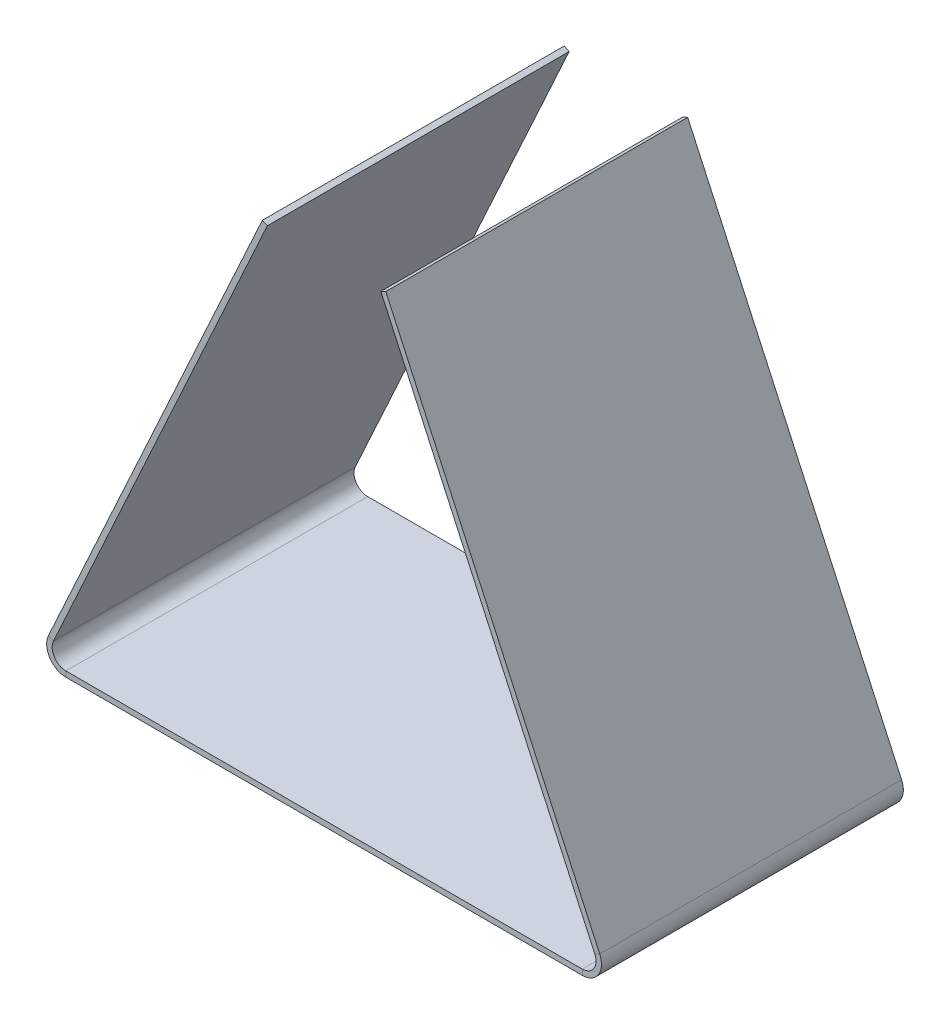
ISO-10303-21;
HEADER;
FILE_DESCRIPTION(('STEP AP214'),'2;1');
FILE_NAME('part.step','',(''),(''),'','','');
FILE_SCHEMA(('AUTOMOTIVE_DESIGN { 1 0 10303 214 1 1 1 1 }'));
ENDSEC;
DATA;
#1=APPLICATION_CONTEXT('core data for automotive mechanical design processes');
#2=APPLICATION_PROTOCOL_DEFINITION('international standard','automotive_design',2000,#1);
#3=PRODUCT_CONTEXT('',#1,'mechanical');
#4=PRODUCT('Part','Part','',(#3));
#5=PRODUCT_RELATED_PRODUCT_CATEGORY('part','',(#4));
#6=PRODUCT_DEFINITION_FORMATION('','',#4);
#7=PRODUCT_DEFINITION_CONTEXT('part definition',#1,'design');
#8=PRODUCT_DEFINITION('design','',#6,#7);
#9=PRODUCT_DEFINITION_SHAPE('','',#8);
#10=(LENGTH_UNIT() NAMED_UNIT(*) SI_UNIT(.MILLI.,.METRE.));
#11=(NAMED_UNIT(*) PLANE_ANGLE_UNIT() SI_UNIT($,.RADIAN.));
#12=(NAMED_UNIT(*) SI_UNIT($,.STERADIAN.) SOLID_ANGLE_UNIT());
#13=UNCERTAINTY_MEASURE_WITH_UNIT(LENGTH_MEASURE(1.E-05),#10,'distance_accuracy_value','');
#14=(GEOMETRIC_REPRESENTATION_CONTEXT(3) GLOBAL_UNCERTAINTY_ASSIGNED_CONTEXT((#13)) GLOBAL_UNIT_ASSIGNED_CONTEXT((#10,
#11,#12)) REPRESENTATION_CONTEXT('',''));
#15=CARTESIAN_POINT('',(0.,0.,0.));
#16=DIRECTION('',(0.,0.,1.));
#17=DIRECTION('',(1.,0.,0.));
#18=AXIS2_PLACEMENT_3D('',#15,#16,#17);
#19=CARTESIAN_POINT('',(101.883270202925,2.,1.99840144432528E-12));
#20=DIRECTION('',(0.,0.,0.999999999999997));
#21=DIRECTION('',(-0.999999999999995,0.,0.));
#22=AXIS2_PLACEMENT_3D('',#19,#20,#21);
#23=PLANE('',#22);
#24=DIRECTION('',(0.,0.999999999999997,0.));
#25=VECTOR('',#24,1.);
#26=CARTESIAN_POINT('',(94.0914457102403,2.,1.11022302462516E-12));
#27=LINE('',#26,#25);
#28=CARTESIAN_POINT('',(94.0914457102403,0.,4.44089209850063E-13));
#29=VERTEX_POINT('',#28);
#30=CARTESIAN_POINT('',(94.0914457102403,2.,1.11022302462516E-12));
#31=VERTEX_POINT('',#30);
#32=EDGE_CURVE('E11',#29,#31,#27,.T.);
#33=ORIENTED_EDGE('',*,*,#32,.F.);
#34=DIRECTION('',(0.999999999999995,0.,0.));
#35=VECTOR('',#34,1.);
#36=CARTESIAN_POINT('',(101.883270202925,1.11022302462516E-13,1.66533453693773E-13));
#37=LINE('',#36,#35);
#38=CARTESIAN_POINT('',(-94.0914457102404,-1.11022302462516E-13,0.));
#39=VERTEX_POINT('',#38);
#40=EDGE_CURVE('E95',#29,#39,#37,.F.);
#41=ORIENTED_EDGE('',*,*,#40,.T.);
#42=DIRECTION('',(0.,0.999999999999997,0.));
#43=VECTOR('',#42,1.);
#44=CARTESIAN_POINT('',(-94.0914457102404,1.99999999999989,1.99840144432528E-12));
#45=LINE('',#44,#43);
#46=CARTESIAN_POINT('',(-94.0914457102404,1.99999999999989,1.99840144432528E-12));
#47=VERTEX_POINT('',#46);
#48=EDGE_CURVE('E48',#39,#47,#45,.T.);
#49=ORIENTED_EDGE('',*,*,#48,.T.);
#50=DIRECTION('',(-0.999999999999995,0.,0.));
#51=VECTOR('',#50,1.);
#52=CARTESIAN_POINT('',(101.883270202925,2.,1.99840144432528E-12));
#53=LINE('',#52,#51);
#54=EDGE_CURVE('E97',#31,#47,#53,.T.);
#55=ORIENTED_EDGE('',*,*,#54,.F.);
#56=EDGE_LOOP('',(#33,#41,#49,#55));
#57=FACE_BOUND('',#56,.T.);
#58=ADVANCED_FACE('F38',(#57),#23,.F.);
#59=CARTESIAN_POINT('',(-94.0914457102404,7.00000000000012,6.66133814775094E-13));
#60=DIRECTION('',(0.,0.,-0.999999999999997));
#61=DIRECTION('',(-0.999999999999995,0.,0.));
#62=AXIS2_PLACEMENT_3D('',#59,#60,#61);
#63=PLANE('',#62);
#64=ORIENTED_EDGE('',*,*,#48,.F.);
#65=CARTESIAN_POINT('',(-94.0914457102404,7.00000000000012,6.66133814775094E-13));
#66=DIRECTION('',(0.,0.,0.999999999999997));
#67=DIRECTION('',(0.999999999999995,0.,0.));
#68=AXIS2_PLACEMENT_3D('',#65,#66,#67);
#69=CIRCLE('',#68,7.);
#70=CARTESIAN_POINT('',(-100.4548994705,9.91658297345266,4.44089209850063E-13));
#71=VERTEX_POINT('',#70);
#72=EDGE_CURVE('E136',#39,#71,#69,.F.);
#73=ORIENTED_EDGE('',*,*,#72,.T.);
#74=DIRECTION('',(0.909064822894279,-0.416654710493212,0.));
#75=VECTOR('',#74,1.);
#76=CARTESIAN_POINT('',(-98.6367698247118,9.08327355246607,0.));
#77=LINE('',#76,#75);
#78=CARTESIAN_POINT('',(-98.6367698247118,9.08327355246607,0.));
#79=VERTEX_POINT('',#78);
#80=EDGE_CURVE('E163',#71,#79,#77,.T.);
#81=ORIENTED_EDGE('',*,*,#80,.T.);
#82=CARTESIAN_POINT('',(-94.0914457102404,7.00000000000012,6.66133814775094E-13));
#83=DIRECTION('',(0.,0.,0.999999999999997));
#84=DIRECTION('',(0.999999999999995,0.,0.));
#85=AXIS2_PLACEMENT_3D('',#82,#83,#84);
#86=CIRCLE('',#85,5.);
#87=EDGE_CURVE('E172',#47,#79,#86,.F.);
#88=ORIENTED_EDGE('',*,*,#87,.F.);
#89=EDGE_LOOP('',(#64,#73,#81,#88));
#90=FACE_BOUND('',#89,.T.);
#91=ADVANCED_FACE('F171',(#90),#63,.T.);
#92=CARTESIAN_POINT('',(-20.6818703542114,179.166690579013,0.));
#93=DIRECTION('',(0.,0.,0.999999999999997));
#94=DIRECTION('',(0.416654710493211,0.909064822894282,0.));
#95=AXIS2_PLACEMENT_3D('',#92,#93,#94);
#96=PLANE('',#95);
#97=ORIENTED_EDGE('',*,*,#80,.F.);
#98=DIRECTION('',(-0.416654710493211,-0.909064822894282,0.));
#99=VECTOR('',#98,1.);
#100=CARTESIAN_POINT('',(-22.5,179.999999999999,0.));
#101=LINE('',#100,#99);
#102=CARTESIAN_POINT('',(-22.5,179.999999999999,0.));
#103=VERTEX_POINT('',#102);
#104=EDGE_CURVE('E133',#71,#103,#101,.F.);
#105=ORIENTED_EDGE('',*,*,#104,.T.);
#106=DIRECTION('',(0.909064822894279,-0.416654710493212,0.));
#107=VECTOR('',#106,1.);
#108=CARTESIAN_POINT('',(-20.6818703542114,179.166690579013,0.));
#109=LINE('',#108,#107);
#110=CARTESIAN_POINT('',(-20.6818703542114,179.166690579013,0.));
#111=VERTEX_POINT('',#110);
#112=EDGE_CURVE('E160',#103,#111,#109,.T.);
#113=ORIENTED_EDGE('',*,*,#112,.T.);
#114=DIRECTION('',(0.416654710493211,0.909064822894282,0.));
#115=VECTOR('',#114,1.);
#116=CARTESIAN_POINT('',(-20.6818703542114,179.166690579013,0.));
#117=LINE('',#116,#115);
#118=EDGE_CURVE('E191',#79,#111,#117,.T.);
#119=ORIENTED_EDGE('',*,*,#118,.F.);
#120=EDGE_LOOP('',(#97,#105,#113,#119));
#121=FACE_BOUND('',#120,.T.);
#122=ADVANCED_FACE('F192',(#121),#96,.F.);
#123=CARTESIAN_POINT('',(-20.6818703542114,179.166690579013,110.000000000001));
#124=DIRECTION('',(0.416654710493211,0.909064822894282,0.));
#125=DIRECTION('',(0.,0.,-0.999999999999997));
#126=AXIS2_PLACEMENT_3D('',#123,#124,#125);
#127=PLANE('',#126);
#128=ORIENTED_EDGE('',*,*,#112,.F.);
#129=DIRECTION('',(0.,0.,0.999999999999997));
#130=VECTOR('',#129,1.);
#131=CARTESIAN_POINT('',(-22.4999999999999,179.999999999999,110.));
#132=LINE('',#131,#130);
#133=CARTESIAN_POINT('',(-22.4999999999999,179.999999999999,110.));
#134=VERTEX_POINT('',#133);
#135=EDGE_CURVE('E229',#134,#103,#132,.F.);
#136=ORIENTED_EDGE('',*,*,#135,.F.);
#137=DIRECTION('',(0.909064822894279,-0.416654710493212,0.));
#138=VECTOR('',#137,1.);
#139=CARTESIAN_POINT('',(-20.6818703542114,179.166690579013,110.000000000001));
#140=LINE('',#139,#138);
#141=CARTESIAN_POINT('',(-20.6818703542114,179.166690579013,110.000000000001));
#142=VERTEX_POINT('',#141);
#143=EDGE_CURVE('E157',#134,#142,#140,.T.);
#144=ORIENTED_EDGE('',*,*,#143,.T.);
#145=DIRECTION('',(0.,0.,-0.999999999999997));
#146=VECTOR('',#145,1.);
#147=CARTESIAN_POINT('',(-20.6818703542114,179.166690579013,110.000000000001));
#148=LINE('',#147,#146);
#149=EDGE_CURVE('E196',#142,#111,#148,.T.);
#150=ORIENTED_EDGE('',*,*,#149,.T.);
#151=EDGE_LOOP('',(#128,#136,#144,#150));
#152=FACE_BOUND('',#151,.T.);
#153=ADVANCED_FACE('F240',(#152),#127,.T.);
#154=CARTESIAN_POINT('',(-20.6818703542114,179.166690579013,110.000000000001));
#155=DIRECTION('',(0.,0.,0.999999999999997));
#156=DIRECTION('',(0.416654710493211,0.909064822894282,0.));
#157=AXIS2_PLACEMENT_3D('',#154,#155,#156);
#158=PLANE('',#157);
#159=ORIENTED_EDGE('',*,*,#143,.F.);
#160=DIRECTION('',(-0.416654710493211,-0.909064822894282,0.));
#161=VECTOR('',#160,1.);
#162=CARTESIAN_POINT('',(-22.4999999999999,179.999999999999,110.));
#163=LINE('',#162,#161);
#164=CARTESIAN_POINT('',(-100.4548994705,9.91658297345244,110.000000000002));
#165=VERTEX_POINT('',#164);
#166=EDGE_CURVE('E126',#165,#134,#163,.F.);
#167=ORIENTED_EDGE('',*,*,#166,.F.);
#168=DIRECTION('',(0.909064822894276,-0.416654710493219,0.));
#169=VECTOR('',#168,1.);
#170=CARTESIAN_POINT('',(-98.6367698247117,9.08327355246607,110.));
#171=LINE('',#170,#169);
#172=CARTESIAN_POINT('',(-98.6367698247117,9.08327355246607,110.));
#173=VERTEX_POINT('',#172);
#174=EDGE_CURVE('E154',#165,#173,#171,.T.);
#175=ORIENTED_EDGE('',*,*,#174,.T.);
#176=DIRECTION('',(0.416654710493211,0.909064822894282,0.));
#177=VECTOR('',#176,1.);
#178=CARTESIAN_POINT('',(-20.6818703542114,179.166690579013,110.000000000001));
#179=LINE('',#178,#177);
#180=EDGE_CURVE('E202',#173,#142,#179,.T.);
#181=ORIENTED_EDGE('',*,*,#180,.T.);
#182=EDGE_LOOP('',(#159,#167,#175,#181));
#183=FACE_BOUND('',#182,.T.);
#184=ADVANCED_FACE('F290',(#183),#158,.T.);
#185=CARTESIAN_POINT('',(-94.0914457102403,6.9999999999999,110.000000000001));
#186=DIRECTION('',(0.,0.,0.999999999999997));
#187=DIRECTION('',(0.999999999999995,0.,0.));
#188=AXIS2_PLACEMENT_3D('',#185,#186,#187);
#189=PLANE('',#188);
#190=ORIENTED_EDGE('',*,*,#174,.F.);
#191=CARTESIAN_POINT('',(-94.0914457102403,6.9999999999999,110.000000000001));
#192=DIRECTION('',(0.,0.,0.999999999999997));
#193=DIRECTION('',(0.999999999999995,0.,0.));
#194=AXIS2_PLACEMENT_3D('',#191,#192,#193);
#195=CIRCLE('',#194,7.);
#196=CARTESIAN_POINT('',(-94.0914457102402,1.11022302462516E-13,110.000000000002));
#197=VERTEX_POINT('',#196);
#198=EDGE_CURVE('E131',#165,#197,#195,.T.);
#199=ORIENTED_EDGE('',*,*,#198,.T.);
#200=DIRECTION('',(0.,0.999999999999997,0.));
#201=VECTOR('',#200,1.);
#202=CARTESIAN_POINT('',(-94.0914457102403,1.99999999999967,110.));
#203=LINE('',#202,#201);
#204=CARTESIAN_POINT('',(-94.0914457102403,1.99999999999967,110.));
#205=VERTEX_POINT('',#204);
#206=EDGE_CURVE('E152',#197,#205,#203,.T.);
#207=ORIENTED_EDGE('',*,*,#206,.T.);
#208=CARTESIAN_POINT('',(-94.0914457102403,6.9999999999999,110.000000000001));
#209=DIRECTION('',(0.,0.,-0.999999999999997));
#210=DIRECTION('',(-0.999999999999995,0.,0.));
#211=AXIS2_PLACEMENT_3D('',#208,#209,#210);
#212=CIRCLE('',#211,5.);
#213=EDGE_CURVE('E188',#173,#205,#212,.F.);
#214=ORIENTED_EDGE('',*,*,#213,.F.);
#215=EDGE_LOOP('',(#190,#199,#207,#214));
#216=FACE_BOUND('',#215,.T.);
#217=ADVANCED_FACE('F292',(#216),#189,.T.);
#218=CARTESIAN_POINT('',(101.883270202925,1.99999999999978,110.));
#219=DIRECTION('',(0.,0.,0.999999999999997));
#220=DIRECTION('',(-0.999999999999995,0.,0.));
#221=AXIS2_PLACEMENT_3D('',#218,#219,#220);
#222=PLANE('',#221);
#223=ORIENTED_EDGE('',*,*,#206,.F.);
#224=DIRECTION('',(0.999999999999995,0.,0.));
#225=VECTOR('',#224,1.);
#226=CARTESIAN_POINT('',(101.883270202925,1.11022302462516E-13,110.000000000001));
#227=LINE('',#226,#225);
#228=CARTESIAN_POINT('',(94.0914457102404,0.,110.000000000001));
#229=VERTEX_POINT('',#228);
#230=EDGE_CURVE('E125',#229,#197,#227,.F.);
#231=ORIENTED_EDGE('',*,*,#230,.F.);
#232=DIRECTION('',(0.,0.999999999999997,0.));
#233=VECTOR('',#232,1.);
#234=CARTESIAN_POINT('',(94.0914457102404,1.99999999999978,110.));
#235=LINE('',#234,#233);
#236=CARTESIAN_POINT('',(94.0914457102404,1.99999999999978,110.));
#237=VERTEX_POINT('',#236);
#238=EDGE_CURVE('E149',#229,#237,#235,.T.);
#239=ORIENTED_EDGE('',*,*,#238,.T.);
#240=DIRECTION('',(-0.999999999999995,0.,0.));
#241=VECTOR('',#240,1.);
#242=CARTESIAN_POINT('',(101.883270202925,1.99999999999978,110.));
#243=LINE('',#242,#241);
#244=EDGE_CURVE('E247',#237,#205,#243,.T.);
#245=ORIENTED_EDGE('',*,*,#244,.T.);
#246=EDGE_LOOP('',(#223,#231,#239,#245));
#247=FACE_BOUND('',#246,.T.);
#248=ADVANCED_FACE('F295',(#247),#222,.T.);
#249=CARTESIAN_POINT('',(94.0914457102404,6.9999999999999,110.000000000001));
#250=DIRECTION('',(0.,0.,0.999999999999997));
#251=DIRECTION('',(0.999999999999995,0.,0.));
#252=AXIS2_PLACEMENT_3D('',#249,#250,#251);
#253=PLANE('',#252);
#254=ORIENTED_EDGE('',*,*,#238,.F.);
#255=CARTESIAN_POINT('',(94.0914457102404,6.9999999999999,110.000000000001));
#256=DIRECTION('',(0.,0.,0.999999999999997));
#257=DIRECTION('',(0.999999999999995,0.,0.));
#258=AXIS2_PLACEMENT_3D('',#255,#256,#257);
#259=CIRCLE('',#258,7.);
#260=CARTESIAN_POINT('',(100.4548994705,9.91658297345232,110.000000000002));
#261=VERTEX_POINT('',#260);
#262=EDGE_CURVE('E113',#229,#261,#259,.T.);
#263=ORIENTED_EDGE('',*,*,#262,.T.);
#264=DIRECTION('',(-0.909064822894279,-0.416654710493213,0.));
#265=VECTOR('',#264,1.);
#266=CARTESIAN_POINT('',(98.6367698247118,9.08327355246585,110.000000000002));
#267=LINE('',#266,#265);
#268=CARTESIAN_POINT('',(98.6367698247118,9.08327355246585,110.000000000002));
#269=VERTEX_POINT('',#268);
#270=EDGE_CURVE('E146',#261,#269,#267,.T.);
#271=ORIENTED_EDGE('',*,*,#270,.T.);
#272=CARTESIAN_POINT('',(94.0914457102404,6.9999999999999,110.000000000001));
#273=DIRECTION('',(0.,0.,-0.999999999999997));
#274=DIRECTION('',(-0.999999999999995,0.,0.));
#275=AXIS2_PLACEMENT_3D('',#272,#273,#274);
#276=CIRCLE('',#275,5.);
#277=EDGE_CURVE('E197',#237,#269,#276,.F.);
#278=ORIENTED_EDGE('',*,*,#277,.F.);
#279=EDGE_LOOP('',(#254,#263,#271,#278));
#280=FACE_BOUND('',#279,.T.);
#281=ADVANCED_FACE('F322',(#280),#253,.T.);
#282=CARTESIAN_POINT('',(20.6818703542113,179.166690579013,110.000000000001));
#283=DIRECTION('',(0.,0.,0.999999999999997));
#284=DIRECTION('',(0.416654710493211,-0.909064822894281,0.));
#285=AXIS2_PLACEMENT_3D('',#282,#283,#284);
#286=PLANE('',#285);
#287=ORIENTED_EDGE('',*,*,#270,.F.);
#288=DIRECTION('',(-0.416654710493211,0.909064822894281,0.));
#289=VECTOR('',#288,1.);
#290=CARTESIAN_POINT('',(22.4999999999998,179.999999999999,110.));
#291=LINE('',#290,#289);
#292=CARTESIAN_POINT('',(22.4999999999998,179.999999999999,110.));
#293=VERTEX_POINT('',#292);
#294=EDGE_CURVE('E221',#293,#261,#291,.F.);
#295=ORIENTED_EDGE('',*,*,#294,.F.);
#296=DIRECTION('',(-0.909064822894279,-0.416654710493213,0.));
#297=VECTOR('',#296,1.);
#298=CARTESIAN_POINT('',(20.6818703542113,179.166690579013,110.000000000001));
#299=LINE('',#298,#297);
#300=CARTESIAN_POINT('',(20.6818703542113,179.166690579013,110.000000000001));
#301=VERTEX_POINT('',#300);
#302=EDGE_CURVE('E143',#293,#301,#299,.T.);
#303=ORIENTED_EDGE('',*,*,#302,.T.);
#304=DIRECTION('',(0.416654710493211,-0.909064822894281,0.));
#305=VECTOR('',#304,1.);
#306=CARTESIAN_POINT('',(20.6818703542113,179.166690579013,110.000000000001));
#307=LINE('',#306,#305);
#308=EDGE_CURVE('E253',#301,#269,#307,.T.);
#309=ORIENTED_EDGE('',*,*,#308,.T.);
#310=EDGE_LOOP('',(#287,#295,#303,#309));
#311=FACE_BOUND('',#310,.T.);
#312=ADVANCED_FACE('F271',(#311),#286,.T.);
#313=CARTESIAN_POINT('',(20.6818703542113,179.166690579013,110.000000000001));
#314=DIRECTION('',(0.416654710493211,-0.909064822894281,0.));
#315=DIRECTION('',(0.,0.,-0.999999999999997));
#316=AXIS2_PLACEMENT_3D('',#313,#314,#315);
#317=PLANE('',#316);
#318=ORIENTED_EDGE('',*,*,#302,.F.);
#319=DIRECTION('',(0.,0.,0.999999999999997));
#320=VECTOR('',#319,1.);
#321=CARTESIAN_POINT('',(22.4999999999998,179.999999999999,110.));
#322=LINE('',#321,#320);
#323=CARTESIAN_POINT('',(22.4999999999998,179.999999999999,0.));
#324=VERTEX_POINT('',#323);
#325=EDGE_CURVE('E118',#293,#324,#322,.F.);
#326=ORIENTED_EDGE('',*,*,#325,.T.);
#327=DIRECTION('',(-0.909064822894279,-0.416654710493213,0.));
#328=VECTOR('',#327,1.);
#329=CARTESIAN_POINT('',(20.6818703542113,179.166690579013,0.));
#330=LINE('',#329,#328);
#331=CARTESIAN_POINT('',(20.6818703542113,179.166690579013,0.));
#332=VERTEX_POINT('',#331);
#333=EDGE_CURVE('E140',#324,#332,#330,.T.);
#334=ORIENTED_EDGE('',*,*,#333,.T.);
#335=DIRECTION('',(0.,0.,-0.999999999999997));
#336=VECTOR('',#335,1.);
#337=CARTESIAN_POINT('',(20.6818703542113,179.166690579013,110.000000000001));
#338=LINE('',#337,#336);
#339=EDGE_CURVE('E256',#301,#332,#338,.T.);
#340=ORIENTED_EDGE('',*,*,#339,.F.);
#341=EDGE_LOOP('',(#318,#326,#334,#340));
#342=FACE_BOUND('',#341,.T.);
#343=ADVANCED_FACE('F327',(#342),#317,.F.);
#344=CARTESIAN_POINT('',(20.6818703542113,179.166690579013,0.));
#345=DIRECTION('',(0.,0.,0.999999999999997));
#346=DIRECTION('',(0.416654710493211,-0.909064822894281,0.));
#347=AXIS2_PLACEMENT_3D('',#344,#345,#346);
#348=PLANE('',#347);
#349=ORIENTED_EDGE('',*,*,#333,.F.);
#350=DIRECTION('',(-0.416654710493211,0.909064822894281,0.));
#351=VECTOR('',#350,1.);
#352=CARTESIAN_POINT('',(22.4999999999998,179.999999999999,0.));
#353=LINE('',#352,#351);
#354=CARTESIAN_POINT('',(100.4548994705,9.91658297345266,1.27675647831893E-12));
#355=VERTEX_POINT('',#354);
#356=EDGE_CURVE('E219',#324,#355,#353,.F.);
#357=ORIENTED_EDGE('',*,*,#356,.T.);
#358=DIRECTION('',(-0.909064822894279,-0.416654710493212,0.));
#359=VECTOR('',#358,1.);
#360=CARTESIAN_POINT('',(98.6367698247117,9.08327355246596,1.11022302462516E-12));
#361=LINE('',#360,#359);
#362=CARTESIAN_POINT('',(98.6367698247117,9.08327355246596,1.11022302462516E-12));
#363=VERTEX_POINT('',#362);
#364=EDGE_CURVE('E42',#355,#363,#361,.T.);
#365=ORIENTED_EDGE('',*,*,#364,.T.);
#366=DIRECTION('',(0.416654710493211,-0.909064822894281,0.));
#367=VECTOR('',#366,1.);
#368=CARTESIAN_POINT('',(20.6818703542113,179.166690579013,0.));
#369=LINE('',#368,#367);
#370=EDGE_CURVE('E250',#332,#363,#369,.T.);
#371=ORIENTED_EDGE('',*,*,#370,.F.);
#372=EDGE_LOOP('',(#349,#357,#365,#371));
#373=FACE_BOUND('',#372,.T.);
#374=ADVANCED_FACE('F281',(#373),#348,.F.);
#375=CARTESIAN_POINT('',(94.0914457102403,7.00000000000001,-2.77555756156289E-13));
#376=DIRECTION('',(0.,0.,-0.999999999999997));
#377=DIRECTION('',(-0.999999999999995,0.,0.));
#378=AXIS2_PLACEMENT_3D('',#375,#376,#377);
#379=PLANE('',#378);
#380=CARTESIAN_POINT('',(94.0914457102403,7.00000000000001,-2.77555756156289E-13));
#381=DIRECTION('',(0.,0.,0.999999999999997));
#382=DIRECTION('',(0.999999999999995,0.,0.));
#383=AXIS2_PLACEMENT_3D('',#380,#381,#382);
#384=CIRCLE('',#383,7.);
#385=EDGE_CURVE('E110',#355,#29,#384,.F.);
#386=ORIENTED_EDGE('',*,*,#385,.T.);
#387=ORIENTED_EDGE('',*,*,#32,.T.);
#388=CARTESIAN_POINT('',(94.0914457102403,7.00000000000001,-2.77555756156289E-13));
#389=DIRECTION('',(0.,0.,0.999999999999997));
#390=DIRECTION('',(0.999999999999995,0.,0.));
#391=AXIS2_PLACEMENT_3D('',#388,#389,#390);
#392=CIRCLE('',#391,5.);
#393=EDGE_CURVE('E214',#363,#31,#392,.F.);
#394=ORIENTED_EDGE('',*,*,#393,.F.);
#395=ORIENTED_EDGE('',*,*,#364,.F.);
#396=EDGE_LOOP('',(#386,#387,#394,#395));
#397=FACE_BOUND('',#396,.T.);
#398=ADVANCED_FACE('F40',(#397),#379,.T.);
#399=CARTESIAN_POINT('',(20.6818703542113,179.166690579013,110.000000000001));
#400=DIRECTION('',(0.909064822894279,0.416654710493213,0.));
#401=DIRECTION('',(-0.416654710493211,0.909064822894281,0.));
#402=AXIS2_PLACEMENT_3D('',#399,#400,#401);
#403=PLANE('',#402);
#404=ORIENTED_EDGE('',*,*,#370,.T.);
#405=DIRECTION('',(0.,0.,-0.999999999999997));
#406=VECTOR('',#405,1.);
#407=CARTESIAN_POINT('',(98.6367698247118,9.08327355246585,110.000000000002));
#408=LINE('',#407,#406);
#409=EDGE_CURVE('E204',#363,#269,#408,.F.);
#410=ORIENTED_EDGE('',*,*,#409,.T.);
#411=ORIENTED_EDGE('',*,*,#308,.F.);
#412=ORIENTED_EDGE('',*,*,#339,.T.);
#413=EDGE_LOOP('',(#404,#410,#411,#412));
#414=FACE_BOUND('',#413,.T.);
#415=ADVANCED_FACE('F276',(#414),#403,.F.);
#416=CARTESIAN_POINT('',(101.883270202925,1.99999999999978,110.));
#417=DIRECTION('',(0.,-0.999999999999997,0.));
#418=DIRECTION('',(0.999999999999995,0.,0.));
#419=AXIS2_PLACEMENT_3D('',#416,#417,#418);
#420=PLANE('',#419);
#421=ORIENTED_EDGE('',*,*,#54,.T.);
#422=DIRECTION('',(0.,0.,-0.999999999999997));
#423=VECTOR('',#422,1.);
#424=CARTESIAN_POINT('',(-94.0914457102403,1.99999999999967,110.));
#425=LINE('',#424,#423);
#426=EDGE_CURVE('E187',#47,#205,#425,.F.);
#427=ORIENTED_EDGE('',*,*,#426,.T.);
#428=ORIENTED_EDGE('',*,*,#244,.F.);
#429=DIRECTION('',(0.,0.,-0.999999999999997));
#430=VECTOR('',#429,1.);
#431=CARTESIAN_POINT('',(94.0914457102403,2.,1.11022302462516E-12));
#432=LINE('',#431,#430);
#433=EDGE_CURVE('E208',#237,#31,#432,.T.);
#434=ORIENTED_EDGE('',*,*,#433,.T.);
#435=EDGE_LOOP('',(#421,#427,#428,#434));
#436=FACE_BOUND('',#435,.T.);
#437=ADVANCED_FACE('F297',(#436),#420,.F.);
#438=CARTESIAN_POINT('',(-20.6818703542114,179.166690579013,110.000000000001));
#439=DIRECTION('',(-0.909064822894279,0.416654710493212,0.));
#440=DIRECTION('',(-0.416654710493211,-0.909064822894282,0.));
#441=AXIS2_PLACEMENT_3D('',#438,#439,#440);
#442=PLANE('',#441);
#443=ORIENTED_EDGE('',*,*,#180,.F.);
#444=DIRECTION('',(0.,0.,-0.999999999999997));
#445=VECTOR('',#444,1.);
#446=CARTESIAN_POINT('',(-98.6367698247118,9.08327355246596,0.));
#447=LINE('',#446,#445);
#448=EDGE_CURVE('E185',#173,#79,#447,.T.);
#449=ORIENTED_EDGE('',*,*,#448,.T.);
#450=ORIENTED_EDGE('',*,*,#118,.T.);
#451=ORIENTED_EDGE('',*,*,#149,.F.);
#452=EDGE_LOOP('',(#443,#449,#450,#451));
#453=FACE_BOUND('',#452,.T.);
#454=ADVANCED_FACE('F200',(#453),#442,.F.);
#455=CARTESIAN_POINT('',(94.0914457102404,6.9999999999999,110.000000000001));
#456=DIRECTION('',(0.,0.,0.999999999999997));
#457=DIRECTION('',(0.999999999999995,0.,0.));
#458=AXIS2_PLACEMENT_3D('',#455,#456,#457);
#459=CYLINDRICAL_SURFACE('',#458,5.);
#460=ORIENTED_EDGE('',*,*,#277,.T.);
#461=ORIENTED_EDGE('',*,*,#409,.F.);
#462=ORIENTED_EDGE('',*,*,#393,.T.);
#463=ORIENTED_EDGE('',*,*,#433,.F.);
#464=EDGE_LOOP('',(#460,#461,#462,#463));
#465=FACE_BOUND('',#464,.T.);
#466=ADVANCED_FACE('F264',(#465),#459,.F.);
#467=CARTESIAN_POINT('',(-94.0914457102403,6.9999999999999,110.000000000001));
#468=DIRECTION('',(0.,0.,0.999999999999997));
#469=DIRECTION('',(0.999999999999995,0.,0.));
#470=AXIS2_PLACEMENT_3D('',#467,#468,#469);
#471=CYLINDRICAL_SURFACE('',#470,5.);
#472=ORIENTED_EDGE('',*,*,#213,.T.);
#473=ORIENTED_EDGE('',*,*,#426,.F.);
#474=ORIENTED_EDGE('',*,*,#87,.T.);
#475=ORIENTED_EDGE('',*,*,#448,.F.);
#476=EDGE_LOOP('',(#472,#473,#474,#475));
#477=FACE_BOUND('',#476,.T.);
#478=ADVANCED_FACE('F183',(#477),#471,.F.);
#479=CARTESIAN_POINT('',(22.4999999999998,179.999999999999,110.));
#480=DIRECTION('',(0.909064822894279,0.416654710493213,0.));
#481=DIRECTION('',(-0.416654710493211,0.909064822894281,0.));
#482=AXIS2_PLACEMENT_3D('',#479,#480,#481);
#483=PLANE('',#482);
#484=ORIENTED_EDGE('',*,*,#356,.F.);
#485=ORIENTED_EDGE('',*,*,#325,.F.);
#486=ORIENTED_EDGE('',*,*,#294,.T.);
#487=DIRECTION('',(0.,0.,0.999999999999997));
#488=VECTOR('',#487,1.);
#489=CARTESIAN_POINT('',(100.4548994705,9.91658297345232,110.000000000002));
#490=LINE('',#489,#488);
#491=EDGE_CURVE('E117',#355,#261,#490,.T.);
#492=ORIENTED_EDGE('',*,*,#491,.F.);
#493=EDGE_LOOP('',(#484,#485,#486,#492));
#494=FACE_BOUND('',#493,.T.);
#495=ADVANCED_FACE('F342',(#494),#483,.T.);
#496=CARTESIAN_POINT('',(101.883270202925,1.11022302462516E-13,110.000000000001));
#497=DIRECTION('',(0.,-0.999999999999997,0.));
#498=DIRECTION('',(0.999999999999995,0.,0.));
#499=AXIS2_PLACEMENT_3D('',#496,#497,#498);
#500=PLANE('',#499);
#501=ORIENTED_EDGE('',*,*,#40,.F.);
#502=DIRECTION('',(0.,0.,0.999999999999997));
#503=VECTOR('',#502,1.);
#504=CARTESIAN_POINT('',(94.0914457102404,0.,110.000000000001));
#505=LINE('',#504,#503);
#506=EDGE_CURVE('E107',#229,#29,#505,.F.);
#507=ORIENTED_EDGE('',*,*,#506,.F.);
#508=ORIENTED_EDGE('',*,*,#230,.T.);
#509=DIRECTION('',(0.,0.,0.999999999999997));
#510=VECTOR('',#509,1.);
#511=CARTESIAN_POINT('',(-94.0914457102402,1.11022302462516E-13,110.000000000002));
#512=LINE('',#511,#510);
#513=EDGE_CURVE('E123',#39,#197,#512,.T.);
#514=ORIENTED_EDGE('',*,*,#513,.F.);
#515=EDGE_LOOP('',(#501,#507,#508,#514));
#516=FACE_BOUND('',#515,.T.);
#517=ADVANCED_FACE('F121',(#516),#500,.T.);
#518=CARTESIAN_POINT('',(-22.4999999999999,179.999999999999,110.));
#519=DIRECTION('',(-0.909064822894279,0.416654710493212,0.));
#520=DIRECTION('',(-0.416654710493211,-0.909064822894282,0.));
#521=AXIS2_PLACEMENT_3D('',#518,#519,#520);
#522=PLANE('',#521);
#523=ORIENTED_EDGE('',*,*,#166,.T.);
#524=ORIENTED_EDGE('',*,*,#135,.T.);
#525=ORIENTED_EDGE('',*,*,#104,.F.);
#526=DIRECTION('',(0.,0.,0.999999999999997));
#527=VECTOR('',#526,1.);
#528=CARTESIAN_POINT('',(-100.4548994705,9.91658297345244,110.000000000002));
#529=LINE('',#528,#527);
#530=EDGE_CURVE('E215',#165,#71,#529,.F.);
#531=ORIENTED_EDGE('',*,*,#530,.F.);
#532=EDGE_LOOP('',(#523,#524,#525,#531));
#533=FACE_BOUND('',#532,.T.);
#534=ADVANCED_FACE('F235',(#533),#522,.T.);
#535=CARTESIAN_POINT('',(94.0914457102404,6.9999999999999,110.000000000001));
#536=DIRECTION('',(0.,0.,0.999999999999997));
#537=DIRECTION('',(0.999999999999995,0.,0.));
#538=AXIS2_PLACEMENT_3D('',#535,#536,#537);
#539=CYLINDRICAL_SURFACE('',#538,7.);
#540=ORIENTED_EDGE('',*,*,#262,.F.);
#541=ORIENTED_EDGE('',*,*,#506,.T.);
#542=ORIENTED_EDGE('',*,*,#385,.F.);
#543=ORIENTED_EDGE('',*,*,#491,.T.);
#544=EDGE_LOOP('',(#540,#541,#542,#543));
#545=FACE_BOUND('',#544,.T.);
#546=ADVANCED_FACE('F108',(#545),#539,.T.);
#547=CARTESIAN_POINT('',(-94.0914457102403,6.9999999999999,110.000000000001));
#548=DIRECTION('',(0.,0.,0.999999999999997));
#549=DIRECTION('',(0.999999999999995,0.,0.));
#550=AXIS2_PLACEMENT_3D('',#547,#548,#549);
#551=CYLINDRICAL_SURFACE('',#550,7.);
#552=ORIENTED_EDGE('',*,*,#198,.F.);
#553=ORIENTED_EDGE('',*,*,#530,.T.);
#554=ORIENTED_EDGE('',*,*,#72,.F.);
#555=ORIENTED_EDGE('',*,*,#513,.T.);
#556=EDGE_LOOP('',(#552,#553,#554,#555));
#557=FACE_BOUND('',#556,.T.);
#558=ADVANCED_FACE('F332',(#557),#551,.T.);
#559=CLOSED_SHELL('',(#58,#91,#122,#153,#184,#217,#248,#281,#312,#343,#374,#398,#415,#437,#454,
#466,#478,#495,#517,#534,#546,#558));
#560=MANIFOLD_SOLID_BREP('B2',#559);
#561=ADVANCED_BREP_SHAPE_REPRESENTATION('',(#18,#560),#14);
#562=SHAPE_DEFINITION_REPRESENTATION(#9,#561);
ENDSEC;
END-ISO-10303-21;
